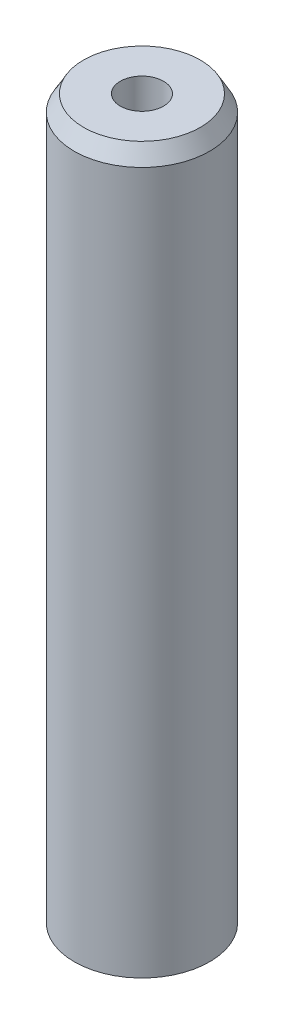
ISO-10303-21;
HEADER;
FILE_DESCRIPTION(('STEP AP214'),'2;1');
FILE_NAME('part.step','',(''),(''),'','','');
FILE_SCHEMA(('AUTOMOTIVE_DESIGN { 1 0 10303 214 1 1 1 1 }'));
ENDSEC;
DATA;
#1=APPLICATION_CONTEXT('core data for automotive mechanical design processes');
#2=APPLICATION_PROTOCOL_DEFINITION('international standard','automotive_design',2000,#1);
#3=PRODUCT_CONTEXT('',#1,'mechanical');
#4=PRODUCT('Part','Part','',(#3));
#5=PRODUCT_RELATED_PRODUCT_CATEGORY('part','',(#4));
#6=PRODUCT_DEFINITION_FORMATION('','',#4);
#7=PRODUCT_DEFINITION_CONTEXT('part definition',#1,'design');
#8=PRODUCT_DEFINITION('design','',#6,#7);
#9=PRODUCT_DEFINITION_SHAPE('','',#8);
#10=(LENGTH_UNIT() NAMED_UNIT(*) SI_UNIT(.MILLI.,.METRE.));
#11=(NAMED_UNIT(*) PLANE_ANGLE_UNIT() SI_UNIT($,.RADIAN.));
#12=(NAMED_UNIT(*) SI_UNIT($,.STERADIAN.) SOLID_ANGLE_UNIT());
#13=UNCERTAINTY_MEASURE_WITH_UNIT(LENGTH_MEASURE(1.E-05),#10,'distance_accuracy_value','');
#14=(GEOMETRIC_REPRESENTATION_CONTEXT(3) GLOBAL_UNCERTAINTY_ASSIGNED_CONTEXT((#13)) GLOBAL_UNIT_ASSIGNED_CONTEXT((#10,
#11,#12)) REPRESENTATION_CONTEXT('',''));
#15=CARTESIAN_POINT('',(0.,0.,0.));
#16=DIRECTION('',(0.,0.,1.));
#17=DIRECTION('',(1.,0.,0.));
#18=AXIS2_PLACEMENT_3D('',#15,#16,#17);
#19=CARTESIAN_POINT('',(0.,214.938473768101,0.));
#20=DIRECTION('',(0.,-1.,0.));
#21=DIRECTION('',(0.,0.,-1.));
#22=AXIS2_PLACEMENT_3D('',#19,#20,#21);
#23=CYLINDRICAL_SURFACE('',#22,20.);
#24=CARTESIAN_POINT('',(0.,210.18773689326,0.));
#25=DIRECTION('',(0.,1.,0.));
#26=DIRECTION('',(0.,0.,1.));
#27=AXIS2_PLACEMENT_3D('',#24,#25,#26);
#28=CIRCLE('',#27,20.);
#29=CARTESIAN_POINT('',(0.,210.18773689326,20.));
#30=VERTEX_POINT('',#29);
#31=EDGE_CURVE('E50',#30,#30,#28,.F.);
#32=ORIENTED_EDGE('',*,*,#31,.T.);
#33=EDGE_LOOP('',(#32));
#34=FACE_BOUND('',#33,.T.);
#35=CARTESIAN_POINT('',(0.,2.74283921353852,0.));
#36=DIRECTION('',(0.,1.,0.));
#37=DIRECTION('',(0.,0.,1.));
#38=AXIS2_PLACEMENT_3D('',#35,#36,#37);
#39=CIRCLE('',#38,20.);
#40=CARTESIAN_POINT('',(0.,2.74283921353852,20.));
#41=VERTEX_POINT('',#40);
#42=EDGE_CURVE('E51',#41,#41,#39,.T.);
#43=ORIENTED_EDGE('',*,*,#42,.T.);
#44=EDGE_LOOP('',(#43));
#45=FACE_BOUND('',#44,.T.);
#46=ADVANCED_FACE('F39',(#34,#45),#23,.T.);
#47=CARTESIAN_POINT('',(0.,214.938473768101,0.));
#48=DIRECTION('',(0.,1.,0.));
#49=DIRECTION('',(0.,0.,1.));
#50=AXIS2_PLACEMENT_3D('',#47,#48,#49);
#51=PLANE('',#50);
#52=CARTESIAN_POINT('',(0.,214.938473768101,0.));
#53=DIRECTION('',(0.,1.,0.));
#54=DIRECTION('',(0.,0.,1.));
#55=AXIS2_PLACEMENT_3D('',#52,#53,#54);
#56=CIRCLE('',#55,17.2571607864615);
#57=CARTESIAN_POINT('',(0.,214.938473768101,17.2571607864615));
#58=VERTEX_POINT('',#57);
#59=EDGE_CURVE('E54',#58,#58,#56,.T.);
#60=ORIENTED_EDGE('',*,*,#59,.T.);
#61=EDGE_LOOP('',(#60));
#62=FACE_BOUND('',#61,.T.);
#63=CARTESIAN_POINT('',(0.,214.938473768101,0.));
#64=DIRECTION('',(0.,1.,0.));
#65=DIRECTION('',(0.,0.,1.));
#66=AXIS2_PLACEMENT_3D('',#63,#64,#65);
#67=CIRCLE('',#66,6.38697344491791);
#68=CARTESIAN_POINT('',(0.,214.938473768101,6.38697344491791));
#69=VERTEX_POINT('',#68);
#70=EDGE_CURVE('E58',#69,#69,#67,.T.);
#71=ORIENTED_EDGE('',*,*,#70,.F.);
#72=EDGE_LOOP('',(#71));
#73=FACE_BOUND('',#72,.T.);
#74=ADVANCED_FACE('F69',(#62,#73),#51,.T.);
#75=CARTESIAN_POINT('',(0.,0.,0.));
#76=DIRECTION('',(0.,1.,0.));
#77=DIRECTION('',(0.,0.,1.));
#78=AXIS2_PLACEMENT_3D('',#75,#76,#77);
#79=PLANE('',#78);
#80=CARTESIAN_POINT('',(0.,0.,0.));
#81=DIRECTION('',(0.,1.,0.));
#82=DIRECTION('',(0.,0.,1.));
#83=AXIS2_PLACEMENT_3D('',#80,#81,#82);
#84=CIRCLE('',#83,15.249263125159);
#85=CARTESIAN_POINT('',(0.,0.,15.249263125159));
#86=VERTEX_POINT('',#85);
#87=EDGE_CURVE('E10',#86,#86,#84,.F.);
#88=ORIENTED_EDGE('',*,*,#87,.T.);
#89=EDGE_LOOP('',(#88));
#90=FACE_BOUND('',#89,.T.);
#91=CARTESIAN_POINT('',(0.,0.,0.));
#92=DIRECTION('',(0.,1.,0.));
#93=DIRECTION('',(0.,0.,1.));
#94=AXIS2_PLACEMENT_3D('',#91,#92,#93);
#95=CIRCLE('',#94,6.38697344491791);
#96=CARTESIAN_POINT('',(0.,0.,6.38697344491791));
#97=VERTEX_POINT('',#96);
#98=EDGE_CURVE('E63',#97,#97,#95,.T.);
#99=ORIENTED_EDGE('',*,*,#98,.T.);
#100=EDGE_LOOP('',(#99));
#101=FACE_BOUND('',#100,.T.);
#102=ADVANCED_FACE('F75',(#90,#101),#79,.F.);
#103=CARTESIAN_POINT('',(0.,214.938473768101,0.));
#104=DIRECTION('',(0.,-1.,0.));
#105=DIRECTION('',(0.,0.,-1.));
#106=AXIS2_PLACEMENT_3D('',#103,#104,#105);
#107=CYLINDRICAL_SURFACE('',#106,6.38697344491791);
#108=ORIENTED_EDGE('',*,*,#70,.T.);
#109=EDGE_LOOP('',(#108));
#110=FACE_BOUND('',#109,.T.);
#111=ORIENTED_EDGE('',*,*,#98,.F.);
#112=EDGE_LOOP('',(#111));
#113=FACE_BOUND('',#112,.T.);
#114=ADVANCED_FACE('F70',(#110,#113),#107,.F.);
#115=CARTESIAN_POINT('',(0.,214.938473768101,0.));
#116=DIRECTION('',(0.,-1.,0.));
#117=DIRECTION('',(0.,0.,-1.));
#118=AXIS2_PLACEMENT_3D('',#115,#116,#117);
#119=CONICAL_SURFACE('',#118,17.2571607864615,0.523598775598292);
#120=ORIENTED_EDGE('',*,*,#31,.F.);
#121=EDGE_LOOP('',(#120));
#122=FACE_BOUND('',#121,.T.);
#123=ORIENTED_EDGE('',*,*,#59,.F.);
#124=EDGE_LOOP('',(#123));
#125=FACE_BOUND('',#124,.T.);
#126=ADVANCED_FACE('F81',(#122,#125),#119,.T.);
#127=CARTESIAN_POINT('',(0.,2.74283921353852,0.));
#128=DIRECTION('',(0.,1.,0.));
#129=DIRECTION('',(0.,0.,1.));
#130=AXIS2_PLACEMENT_3D('',#127,#128,#129);
#131=CONICAL_SURFACE('',#130,20.,1.0471975511966);
#132=ORIENTED_EDGE('',*,*,#87,.F.);
#133=EDGE_LOOP('',(#132));
#134=FACE_BOUND('',#133,.T.);
#135=ORIENTED_EDGE('',*,*,#42,.F.);
#136=EDGE_LOOP('',(#135));
#137=FACE_BOUND('',#136,.T.);
#138=ADVANCED_FACE('F45',(#134,#137),#131,.T.);
#139=CLOSED_SHELL('',(#46,#74,#102,#114,#126,#138));
#140=MANIFOLD_SOLID_BREP('B2',#139);
#141=ADVANCED_BREP_SHAPE_REPRESENTATION('',(#18,#140),#14);
#142=SHAPE_DEFINITION_REPRESENTATION(#9,#141);
ENDSEC;
END-ISO-10303-21;
